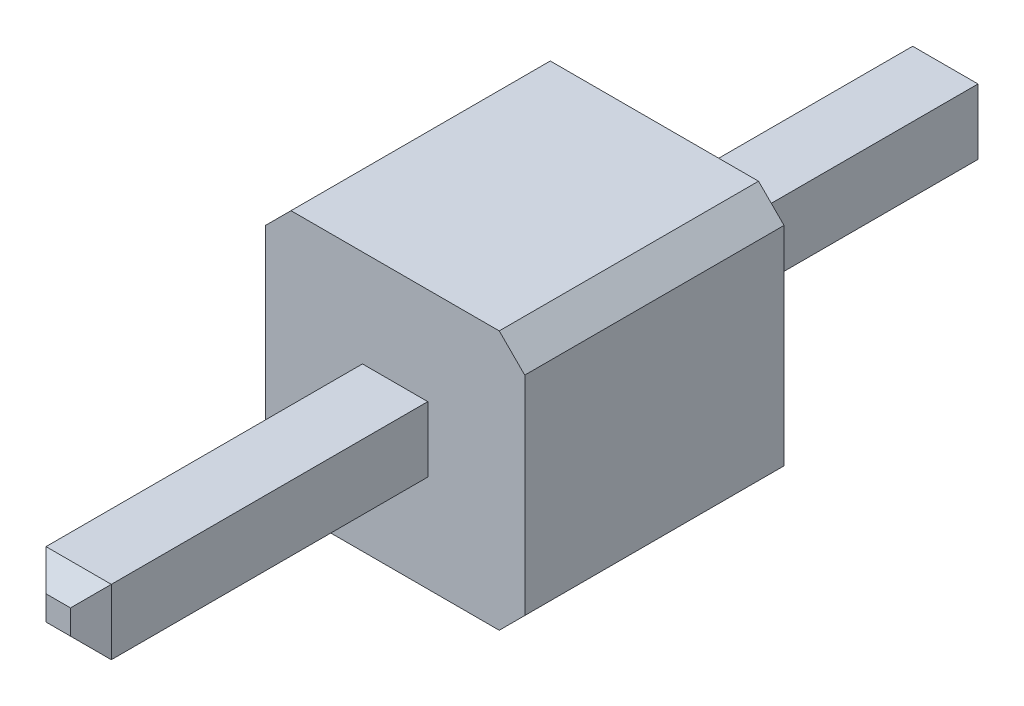
ISO-10303-21;
HEADER;
FILE_DESCRIPTION(('STEP AP214'),'2;1');
FILE_NAME('part.step','',(''),(''),'','','');
FILE_SCHEMA(('AUTOMOTIVE_DESIGN { 1 0 10303 214 1 1 1 1 }'));
ENDSEC;
DATA;
#1=APPLICATION_CONTEXT('core data for automotive mechanical design processes');
#2=APPLICATION_PROTOCOL_DEFINITION('international standard','automotive_design',2000,#1);
#3=PRODUCT_CONTEXT('',#1,'mechanical');
#4=PRODUCT('Part','Part','',(#3));
#5=PRODUCT_RELATED_PRODUCT_CATEGORY('part','',(#4));
#6=PRODUCT_DEFINITION_FORMATION('','',#4);
#7=PRODUCT_DEFINITION_CONTEXT('part definition',#1,'design');
#8=PRODUCT_DEFINITION('design','',#6,#7);
#9=PRODUCT_DEFINITION_SHAPE('','',#8);
#10=(LENGTH_UNIT() NAMED_UNIT(*) SI_UNIT(.MILLI.,.METRE.));
#11=(NAMED_UNIT(*) PLANE_ANGLE_UNIT() SI_UNIT($,.RADIAN.));
#12=(NAMED_UNIT(*) SI_UNIT($,.STERADIAN.) SOLID_ANGLE_UNIT());
#13=UNCERTAINTY_MEASURE_WITH_UNIT(LENGTH_MEASURE(1.E-05),#10,'distance_accuracy_value','');
#14=(GEOMETRIC_REPRESENTATION_CONTEXT(3) GLOBAL_UNCERTAINTY_ASSIGNED_CONTEXT((#13)) GLOBAL_UNIT_ASSIGNED_CONTEXT((#10,
#11,#12)) REPRESENTATION_CONTEXT('',''));
#15=CARTESIAN_POINT('',(0.,0.,0.));
#16=DIRECTION('',(0.,0.,1.));
#17=DIRECTION('',(1.,0.,0.));
#18=AXIS2_PLACEMENT_3D('',#15,#16,#17);
#19=CARTESIAN_POINT('',(0.22,0.,5.74));
#20=DIRECTION('',(0.707106781186548,0.,0.707106781186548));
#21=DIRECTION('',(0.707106781186548,0.,-0.707106781186548));
#22=AXIS2_PLACEMENT_3D('',#19,#20,#21);
#23=PLANE('',#22);
#24=DIRECTION('',(0.,1.,0.));
#25=VECTOR('',#24,1.);
#26=CARTESIAN_POINT('',(0.12,0.,5.84));
#27=LINE('',#26,#25);
#28=CARTESIAN_POINT('',(0.12,-0.12,5.84));
#29=VERTEX_POINT('',#28);
#30=CARTESIAN_POINT('',(0.12,0.12,5.84));
#31=VERTEX_POINT('',#30);
#32=EDGE_CURVE('E20',#29,#31,#27,.T.);
#33=ORIENTED_EDGE('',*,*,#32,.F.);
#34=DIRECTION('',(-0.577350269189626,0.577350269189626,0.577350269189625));
#35=VECTOR('',#34,1.);
#36=CARTESIAN_POINT('',(0.32,-0.32,5.64));
#37=LINE('',#36,#35);
#38=CARTESIAN_POINT('',(0.32,-0.32,5.64));
#39=VERTEX_POINT('',#38);
#40=EDGE_CURVE('E151',#39,#29,#37,.T.);
#41=ORIENTED_EDGE('',*,*,#40,.F.);
#42=DIRECTION('',(0.,1.,0.));
#43=VECTOR('',#42,1.);
#44=CARTESIAN_POINT('',(0.32,0.,5.64));
#45=LINE('',#44,#43);
#46=CARTESIAN_POINT('',(0.32,0.32,5.64));
#47=VERTEX_POINT('',#46);
#48=EDGE_CURVE('E172',#47,#39,#45,.F.);
#49=ORIENTED_EDGE('',*,*,#48,.F.);
#50=DIRECTION('',(0.577350269189626,0.577350269189626,-0.577350269189625));
#51=VECTOR('',#50,1.);
#52=CARTESIAN_POINT('',(0.12,0.12,5.84));
#53=LINE('',#52,#51);
#54=EDGE_CURVE('E168',#31,#47,#53,.T.);
#55=ORIENTED_EDGE('',*,*,#54,.F.);
#56=EDGE_LOOP('',(#33,#41,#49,#55));
#57=FACE_BOUND('',#56,.T.);
#58=ADVANCED_FACE('F17',(#57),#23,.T.);
#59=CARTESIAN_POINT('',(0.,0.,5.84));
#60=DIRECTION('',(0.,0.,1.));
#61=DIRECTION('',(1.,0.,0.));
#62=AXIS2_PLACEMENT_3D('',#59,#60,#61);
#63=PLANE('',#62);
#64=DIRECTION('',(0.,1.,0.));
#65=VECTOR('',#64,1.);
#66=CARTESIAN_POINT('',(-0.12,0.,5.84));
#67=LINE('',#66,#65);
#68=CARTESIAN_POINT('',(-0.12,-0.12,5.84));
#69=VERTEX_POINT('',#68);
#70=CARTESIAN_POINT('',(-0.12,0.12,5.84));
#71=VERTEX_POINT('',#70);
#72=EDGE_CURVE('E184',#69,#71,#67,.T.);
#73=ORIENTED_EDGE('',*,*,#72,.F.);
#74=DIRECTION('',(1.,0.,0.));
#75=VECTOR('',#74,1.);
#76=CARTESIAN_POINT('',(0.,-0.12,5.84));
#77=LINE('',#76,#75);
#78=EDGE_CURVE('E162',#29,#69,#77,.F.);
#79=ORIENTED_EDGE('',*,*,#78,.F.);
#80=ORIENTED_EDGE('',*,*,#32,.T.);
#81=DIRECTION('',(1.,0.,0.));
#82=VECTOR('',#81,1.);
#83=CARTESIAN_POINT('',(0.,0.12,5.84));
#84=LINE('',#83,#82);
#85=EDGE_CURVE('E160',#71,#31,#84,.T.);
#86=ORIENTED_EDGE('',*,*,#85,.F.);
#87=EDGE_LOOP('',(#73,#79,#80,#86));
#88=FACE_BOUND('',#87,.T.);
#89=ADVANCED_FACE('F159',(#88),#63,.T.);
#90=CARTESIAN_POINT('',(0.,0.22,5.74));
#91=DIRECTION('',(0.,0.707106781186548,0.707106781186548));
#92=DIRECTION('',(0.,-0.707106781186548,0.707106781186548));
#93=AXIS2_PLACEMENT_3D('',#90,#91,#92);
#94=PLANE('',#93);
#95=ORIENTED_EDGE('',*,*,#85,.T.);
#96=ORIENTED_EDGE('',*,*,#54,.T.);
#97=DIRECTION('',(1.,0.,0.));
#98=VECTOR('',#97,1.);
#99=CARTESIAN_POINT('',(0.,0.32,5.64));
#100=LINE('',#99,#98);
#101=CARTESIAN_POINT('',(-0.32,0.32,5.64));
#102=VERTEX_POINT('',#101);
#103=EDGE_CURVE('E187',#102,#47,#100,.T.);
#104=ORIENTED_EDGE('',*,*,#103,.F.);
#105=DIRECTION('',(-0.577350269189626,0.577350269189626,-0.577350269189625));
#106=VECTOR('',#105,1.);
#107=CARTESIAN_POINT('',(-0.12,0.12,5.84));
#108=LINE('',#107,#106);
#109=EDGE_CURVE('E170',#71,#102,#108,.T.);
#110=ORIENTED_EDGE('',*,*,#109,.F.);
#111=EDGE_LOOP('',(#95,#96,#104,#110));
#112=FACE_BOUND('',#111,.T.);
#113=ADVANCED_FACE('F166',(#112),#94,.T.);
#114=CARTESIAN_POINT('',(0.,-0.22,5.74));
#115=DIRECTION('',(0.,-0.707106781186548,0.707106781186548));
#116=DIRECTION('',(0.,-0.707106781186548,-0.707106781186548));
#117=AXIS2_PLACEMENT_3D('',#114,#115,#116);
#118=PLANE('',#117);
#119=ORIENTED_EDGE('',*,*,#78,.T.);
#120=DIRECTION('',(0.577350269189626,0.577350269189626,0.577350269189625));
#121=VECTOR('',#120,1.);
#122=CARTESIAN_POINT('',(-0.32,-0.32,5.64));
#123=LINE('',#122,#121);
#124=CARTESIAN_POINT('',(-0.32,-0.32,5.64));
#125=VERTEX_POINT('',#124);
#126=EDGE_CURVE('E181',#125,#69,#123,.T.);
#127=ORIENTED_EDGE('',*,*,#126,.F.);
#128=DIRECTION('',(1.,0.,0.));
#129=VECTOR('',#128,1.);
#130=CARTESIAN_POINT('',(0.,-0.32,5.64));
#131=LINE('',#130,#129);
#132=EDGE_CURVE('E194',#39,#125,#131,.F.);
#133=ORIENTED_EDGE('',*,*,#132,.F.);
#134=ORIENTED_EDGE('',*,*,#40,.T.);
#135=EDGE_LOOP('',(#119,#127,#133,#134));
#136=FACE_BOUND('',#135,.T.);
#137=ADVANCED_FACE('F434',(#136),#118,.T.);
#138=CARTESIAN_POINT('',(0.32,0.,-3.05));
#139=DIRECTION('',(1.,0.,0.));
#140=DIRECTION('',(0.,0.,-1.));
#141=AXIS2_PLACEMENT_3D('',#138,#139,#140);
#142=PLANE('',#141);
#143=DIRECTION('',(0.,1.,0.));
#144=VECTOR('',#143,1.);
#145=CARTESIAN_POINT('',(0.32,0.,2.54));
#146=LINE('',#145,#144);
#147=CARTESIAN_POINT('',(0.32,-0.32,2.54));
#148=VERTEX_POINT('',#147);
#149=CARTESIAN_POINT('',(0.32,0.32,2.54));
#150=VERTEX_POINT('',#149);
#151=EDGE_CURVE('E179',#148,#150,#146,.T.);
#152=ORIENTED_EDGE('',*,*,#151,.T.);
#153=DIRECTION('',(0.,0.,1.));
#154=VECTOR('',#153,1.);
#155=CARTESIAN_POINT('',(0.32,0.32,-3.05));
#156=LINE('',#155,#154);
#157=EDGE_CURVE('E189',#47,#150,#156,.F.);
#158=ORIENTED_EDGE('',*,*,#157,.F.);
#159=ORIENTED_EDGE('',*,*,#48,.T.);
#160=DIRECTION('',(0.,0.,-1.));
#161=VECTOR('',#160,1.);
#162=CARTESIAN_POINT('',(0.32,-0.32,-3.05));
#163=LINE('',#162,#161);
#164=EDGE_CURVE('E198',#148,#39,#163,.F.);
#165=ORIENTED_EDGE('',*,*,#164,.F.);
#166=EDGE_LOOP('',(#152,#158,#159,#165));
#167=FACE_BOUND('',#166,.T.);
#168=ADVANCED_FACE('F430',(#167),#142,.T.);
#169=CARTESIAN_POINT('',(0.,-0.22,-2.95));
#170=DIRECTION('',(0.,-0.707106781186548,-0.707106781186548));
#171=DIRECTION('',(0.,0.707106781186548,-0.707106781186548));
#172=AXIS2_PLACEMENT_3D('',#169,#170,#171);
#173=PLANE('',#172);
#174=DIRECTION('',(1.,0.,0.));
#175=VECTOR('',#174,1.);
#176=CARTESIAN_POINT('',(0.,-0.32,-2.85));
#177=LINE('',#176,#175);
#178=CARTESIAN_POINT('',(-0.32,-0.32,-2.85));
#179=VERTEX_POINT('',#178);
#180=CARTESIAN_POINT('',(0.32,-0.32,-2.85));
#181=VERTEX_POINT('',#180);
#182=EDGE_CURVE('E213',#179,#181,#177,.T.);
#183=ORIENTED_EDGE('',*,*,#182,.F.);
#184=DIRECTION('',(-0.577350269189626,-0.577350269189626,0.577350269189626));
#185=VECTOR('',#184,1.);
#186=CARTESIAN_POINT('',(-0.12,-0.12,-3.05));
#187=LINE('',#186,#185);
#188=CARTESIAN_POINT('',(-0.12,-0.12,-3.05));
#189=VERTEX_POINT('',#188);
#190=EDGE_CURVE('E206',#189,#179,#187,.T.);
#191=ORIENTED_EDGE('',*,*,#190,.F.);
#192=DIRECTION('',(1.,0.,0.));
#193=VECTOR('',#192,1.);
#194=CARTESIAN_POINT('',(0.,-0.12,-3.05));
#195=LINE('',#194,#193);
#196=CARTESIAN_POINT('',(0.12,-0.12,-3.05));
#197=VERTEX_POINT('',#196);
#198=EDGE_CURVE('E201',#189,#197,#195,.T.);
#199=ORIENTED_EDGE('',*,*,#198,.T.);
#200=DIRECTION('',(-0.577350269189626,0.577350269189626,-0.577350269189626));
#201=VECTOR('',#200,1.);
#202=CARTESIAN_POINT('',(0.32,-0.32,-2.85));
#203=LINE('',#202,#201);
#204=EDGE_CURVE('E210',#181,#197,#203,.T.);
#205=ORIENTED_EDGE('',*,*,#204,.F.);
#206=EDGE_LOOP('',(#183,#191,#199,#205));
#207=FACE_BOUND('',#206,.T.);
#208=ADVANCED_FACE('F426',(#207),#173,.T.);
#209=CARTESIAN_POINT('',(-0.22,0.,5.74));
#210=DIRECTION('',(-0.707106781186548,0.,0.707106781186548));
#211=DIRECTION('',(0.707106781186548,0.,0.707106781186548));
#212=AXIS2_PLACEMENT_3D('',#209,#210,#211);
#213=PLANE('',#212);
#214=ORIENTED_EDGE('',*,*,#72,.T.);
#215=ORIENTED_EDGE('',*,*,#109,.T.);
#216=DIRECTION('',(0.,1.,0.));
#217=VECTOR('',#216,1.);
#218=CARTESIAN_POINT('',(-0.32,0.,5.64));
#219=LINE('',#218,#217);
#220=EDGE_CURVE('E217',#125,#102,#219,.T.);
#221=ORIENTED_EDGE('',*,*,#220,.F.);
#222=ORIENTED_EDGE('',*,*,#126,.T.);
#223=EDGE_LOOP('',(#214,#215,#221,#222));
#224=FACE_BOUND('',#223,.T.);
#225=ADVANCED_FACE('F422',(#224),#213,.T.);
#226=CARTESIAN_POINT('',(0.,0.32,-3.05));
#227=DIRECTION('',(0.,1.,0.));
#228=DIRECTION('',(0.,0.,1.));
#229=AXIS2_PLACEMENT_3D('',#226,#227,#228);
#230=PLANE('',#229);
#231=DIRECTION('',(1.,0.,0.));
#232=VECTOR('',#231,1.);
#233=CARTESIAN_POINT('',(0.,0.32,2.54));
#234=LINE('',#233,#232);
#235=CARTESIAN_POINT('',(-0.32,0.32,2.54));
#236=VERTEX_POINT('',#235);
#237=EDGE_CURVE('E192',#150,#236,#234,.F.);
#238=ORIENTED_EDGE('',*,*,#237,.T.);
#239=DIRECTION('',(0.,0.,1.));
#240=VECTOR('',#239,1.);
#241=CARTESIAN_POINT('',(-0.32,0.32,-3.05));
#242=LINE('',#241,#240);
#243=EDGE_CURVE('E220',#102,#236,#242,.F.);
#244=ORIENTED_EDGE('',*,*,#243,.F.);
#245=ORIENTED_EDGE('',*,*,#103,.T.);
#246=ORIENTED_EDGE('',*,*,#157,.T.);
#247=EDGE_LOOP('',(#238,#244,#245,#246));
#248=FACE_BOUND('',#247,.T.);
#249=ADVANCED_FACE('F418',(#248),#230,.T.);
#250=CARTESIAN_POINT('',(0.,-0.32,-3.05));
#251=DIRECTION('',(0.,-1.,0.));
#252=DIRECTION('',(0.,0.,-1.));
#253=AXIS2_PLACEMENT_3D('',#250,#251,#252);
#254=PLANE('',#253);
#255=DIRECTION('',(1.,0.,0.));
#256=VECTOR('',#255,1.);
#257=CARTESIAN_POINT('',(0.,-0.32,2.54));
#258=LINE('',#257,#256);
#259=CARTESIAN_POINT('',(-0.32,-0.32,2.54));
#260=VERTEX_POINT('',#259);
#261=EDGE_CURVE('E196',#260,#148,#258,.T.);
#262=ORIENTED_EDGE('',*,*,#261,.T.);
#263=ORIENTED_EDGE('',*,*,#164,.T.);
#264=ORIENTED_EDGE('',*,*,#132,.T.);
#265=DIRECTION('',(0.,0.,1.));
#266=VECTOR('',#265,1.);
#267=CARTESIAN_POINT('',(-0.32,-0.32,-3.05));
#268=LINE('',#267,#266);
#269=EDGE_CURVE('E223',#260,#125,#268,.T.);
#270=ORIENTED_EDGE('',*,*,#269,.F.);
#271=EDGE_LOOP('',(#262,#263,#264,#270));
#272=FACE_BOUND('',#271,.T.);
#273=ADVANCED_FACE('F414',(#272),#254,.T.);
#274=CARTESIAN_POINT('',(0.,0.,-3.05));
#275=DIRECTION('',(0.,0.,1.));
#276=DIRECTION('',(1.,0.,0.));
#277=AXIS2_PLACEMENT_3D('',#274,#275,#276);
#278=PLANE('',#277);
#279=DIRECTION('',(0.,1.,0.));
#280=VECTOR('',#279,1.);
#281=CARTESIAN_POINT('',(0.12,0.,-3.05));
#282=LINE('',#281,#280);
#283=CARTESIAN_POINT('',(0.12,0.12,-3.05));
#284=VERTEX_POINT('',#283);
#285=EDGE_CURVE('E208',#197,#284,#282,.T.);
#286=ORIENTED_EDGE('',*,*,#285,.F.);
#287=ORIENTED_EDGE('',*,*,#198,.F.);
#288=DIRECTION('',(0.,1.,0.));
#289=VECTOR('',#288,1.);
#290=CARTESIAN_POINT('',(-0.12,0.,-3.05));
#291=LINE('',#290,#289);
#292=CARTESIAN_POINT('',(-0.12,0.12,-3.05));
#293=VERTEX_POINT('',#292);
#294=EDGE_CURVE('E203',#293,#189,#291,.F.);
#295=ORIENTED_EDGE('',*,*,#294,.F.);
#296=DIRECTION('',(1.,0.,0.));
#297=VECTOR('',#296,1.);
#298=CARTESIAN_POINT('',(0.,0.12,-3.05));
#299=LINE('',#298,#297);
#300=EDGE_CURVE('E226',#284,#293,#299,.F.);
#301=ORIENTED_EDGE('',*,*,#300,.F.);
#302=EDGE_LOOP('',(#286,#287,#295,#301));
#303=FACE_BOUND('',#302,.T.);
#304=ADVANCED_FACE('F410',(#303),#278,.F.);
#305=CARTESIAN_POINT('',(-0.22,0.,-2.95));
#306=DIRECTION('',(-0.707106781186548,0.,-0.707106781186548));
#307=DIRECTION('',(-0.707106781186548,0.,0.707106781186548));
#308=AXIS2_PLACEMENT_3D('',#305,#306,#307);
#309=PLANE('',#308);
#310=DIRECTION('',(0.,1.,0.));
#311=VECTOR('',#310,1.);
#312=CARTESIAN_POINT('',(-0.32,0.,-2.85));
#313=LINE('',#312,#311);
#314=CARTESIAN_POINT('',(-0.32,0.32,-2.85));
#315=VERTEX_POINT('',#314);
#316=EDGE_CURVE('E233',#315,#179,#313,.F.);
#317=ORIENTED_EDGE('',*,*,#316,.F.);
#318=DIRECTION('',(-0.577350269189626,0.577350269189626,0.577350269189626));
#319=VECTOR('',#318,1.);
#320=CARTESIAN_POINT('',(-0.12,0.12,-3.05));
#321=LINE('',#320,#319);
#322=EDGE_CURVE('E228',#293,#315,#321,.T.);
#323=ORIENTED_EDGE('',*,*,#322,.F.);
#324=ORIENTED_EDGE('',*,*,#294,.T.);
#325=ORIENTED_EDGE('',*,*,#190,.T.);
#326=EDGE_LOOP('',(#317,#323,#324,#325));
#327=FACE_BOUND('',#326,.T.);
#328=ADVANCED_FACE('F406',(#327),#309,.T.);
#329=CARTESIAN_POINT('',(0.22,0.,-2.95));
#330=DIRECTION('',(0.707106781186548,0.,-0.707106781186548));
#331=DIRECTION('',(-0.707106781186548,0.,-0.707106781186548));
#332=AXIS2_PLACEMENT_3D('',#329,#330,#331);
#333=PLANE('',#332);
#334=DIRECTION('',(0.,1.,0.));
#335=VECTOR('',#334,1.);
#336=CARTESIAN_POINT('',(0.32,0.,-2.85));
#337=LINE('',#336,#335);
#338=CARTESIAN_POINT('',(0.32,0.32,-2.85));
#339=VERTEX_POINT('',#338);
#340=EDGE_CURVE('E241',#181,#339,#337,.T.);
#341=ORIENTED_EDGE('',*,*,#340,.F.);
#342=ORIENTED_EDGE('',*,*,#204,.T.);
#343=ORIENTED_EDGE('',*,*,#285,.T.);
#344=DIRECTION('',(-0.577350269189626,-0.577350269189626,-0.577350269189626));
#345=VECTOR('',#344,1.);
#346=CARTESIAN_POINT('',(0.32,0.32,-2.85));
#347=LINE('',#346,#345);
#348=EDGE_CURVE('E230',#339,#284,#347,.T.);
#349=ORIENTED_EDGE('',*,*,#348,.F.);
#350=EDGE_LOOP('',(#341,#342,#343,#349));
#351=FACE_BOUND('',#350,.T.);
#352=ADVANCED_FACE('F402',(#351),#333,.T.);
#353=CARTESIAN_POINT('',(0.,-0.32,-3.05));
#354=DIRECTION('',(0.,-1.,0.));
#355=DIRECTION('',(0.,0.,-1.));
#356=AXIS2_PLACEMENT_3D('',#353,#354,#355);
#357=PLANE('',#356);
#358=DIRECTION('',(1.,0.,0.));
#359=VECTOR('',#358,1.);
#360=CARTESIAN_POINT('',(0.,-0.32,0.));
#361=LINE('',#360,#359);
#362=CARTESIAN_POINT('',(0.32,-0.32,0.));
#363=VERTEX_POINT('',#362);
#364=CARTESIAN_POINT('',(-0.32,-0.32,0.));
#365=VERTEX_POINT('',#364);
#366=EDGE_CURVE('E215',#363,#365,#361,.F.);
#367=ORIENTED_EDGE('',*,*,#366,.T.);
#368=DIRECTION('',(0.,0.,1.));
#369=VECTOR('',#368,1.);
#370=CARTESIAN_POINT('',(-0.32,-0.32,-3.05));
#371=LINE('',#370,#369);
#372=EDGE_CURVE('E236',#179,#365,#371,.T.);
#373=ORIENTED_EDGE('',*,*,#372,.F.);
#374=ORIENTED_EDGE('',*,*,#182,.T.);
#375=DIRECTION('',(0.,0.,-1.));
#376=VECTOR('',#375,1.);
#377=CARTESIAN_POINT('',(0.32,-0.32,-3.05));
#378=LINE('',#377,#376);
#379=EDGE_CURVE('E245',#363,#181,#378,.T.);
#380=ORIENTED_EDGE('',*,*,#379,.F.);
#381=EDGE_LOOP('',(#367,#373,#374,#380));
#382=FACE_BOUND('',#381,.T.);
#383=ADVANCED_FACE('F398',(#382),#357,.T.);
#384=CARTESIAN_POINT('',(-0.32,0.,-3.05));
#385=DIRECTION('',(-1.,0.,0.));
#386=DIRECTION('',(0.,0.,1.));
#387=AXIS2_PLACEMENT_3D('',#384,#385,#386);
#388=PLANE('',#387);
#389=DIRECTION('',(0.,1.,0.));
#390=VECTOR('',#389,1.);
#391=CARTESIAN_POINT('',(-0.32,0.,2.54));
#392=LINE('',#391,#390);
#393=EDGE_CURVE('E253',#260,#236,#392,.T.);
#394=ORIENTED_EDGE('',*,*,#393,.F.);
#395=ORIENTED_EDGE('',*,*,#269,.T.);
#396=ORIENTED_EDGE('',*,*,#220,.T.);
#397=ORIENTED_EDGE('',*,*,#243,.T.);
#398=EDGE_LOOP('',(#394,#395,#396,#397));
#399=FACE_BOUND('',#398,.T.);
#400=ADVANCED_FACE('F394',(#399),#388,.T.);
#401=CARTESIAN_POINT('',(0.,0.22,-2.95));
#402=DIRECTION('',(0.,0.707106781186548,-0.707106781186548));
#403=DIRECTION('',(0.,0.707106781186548,0.707106781186548));
#404=AXIS2_PLACEMENT_3D('',#401,#402,#403);
#405=PLANE('',#404);
#406=DIRECTION('',(1.,0.,0.));
#407=VECTOR('',#406,1.);
#408=CARTESIAN_POINT('',(0.,0.32,-2.85));
#409=LINE('',#408,#407);
#410=EDGE_CURVE('E266',#339,#315,#409,.F.);
#411=ORIENTED_EDGE('',*,*,#410,.F.);
#412=ORIENTED_EDGE('',*,*,#348,.T.);
#413=ORIENTED_EDGE('',*,*,#300,.T.);
#414=ORIENTED_EDGE('',*,*,#322,.T.);
#415=EDGE_LOOP('',(#411,#412,#413,#414));
#416=FACE_BOUND('',#415,.T.);
#417=ADVANCED_FACE('F390',(#416),#405,.T.);
#418=CARTESIAN_POINT('',(-0.32,0.,-3.05));
#419=DIRECTION('',(-1.,0.,0.));
#420=DIRECTION('',(0.,0.,1.));
#421=AXIS2_PLACEMENT_3D('',#418,#419,#420);
#422=PLANE('',#421);
#423=DIRECTION('',(0.,1.,0.));
#424=VECTOR('',#423,1.);
#425=CARTESIAN_POINT('',(-0.32,0.,0.));
#426=LINE('',#425,#424);
#427=CARTESIAN_POINT('',(-0.32,0.32,0.));
#428=VERTEX_POINT('',#427);
#429=EDGE_CURVE('E239',#365,#428,#426,.T.);
#430=ORIENTED_EDGE('',*,*,#429,.T.);
#431=DIRECTION('',(0.,0.,1.));
#432=VECTOR('',#431,1.);
#433=CARTESIAN_POINT('',(-0.32,0.32,-3.05));
#434=LINE('',#433,#432);
#435=EDGE_CURVE('E269',#315,#428,#434,.T.);
#436=ORIENTED_EDGE('',*,*,#435,.F.);
#437=ORIENTED_EDGE('',*,*,#316,.T.);
#438=ORIENTED_EDGE('',*,*,#372,.T.);
#439=EDGE_LOOP('',(#430,#436,#437,#438));
#440=FACE_BOUND('',#439,.T.);
#441=ADVANCED_FACE('F386',(#440),#422,.T.);
#442=CARTESIAN_POINT('',(0.32,0.,-3.05));
#443=DIRECTION('',(1.,0.,0.));
#444=DIRECTION('',(0.,0.,-1.));
#445=AXIS2_PLACEMENT_3D('',#442,#443,#444);
#446=PLANE('',#445);
#447=DIRECTION('',(0.,1.,0.));
#448=VECTOR('',#447,1.);
#449=CARTESIAN_POINT('',(0.32,0.,0.));
#450=LINE('',#449,#448);
#451=CARTESIAN_POINT('',(0.32,0.32,0.));
#452=VERTEX_POINT('',#451);
#453=EDGE_CURVE('E243',#452,#363,#450,.F.);
#454=ORIENTED_EDGE('',*,*,#453,.T.);
#455=ORIENTED_EDGE('',*,*,#379,.T.);
#456=ORIENTED_EDGE('',*,*,#340,.T.);
#457=DIRECTION('',(0.,0.,1.));
#458=VECTOR('',#457,1.);
#459=CARTESIAN_POINT('',(0.32,0.32,-3.05));
#460=LINE('',#459,#458);
#461=EDGE_CURVE('E272',#452,#339,#460,.F.);
#462=ORIENTED_EDGE('',*,*,#461,.F.);
#463=EDGE_LOOP('',(#454,#455,#456,#462));
#464=FACE_BOUND('',#463,.T.);
#465=ADVANCED_FACE('F383',(#464),#446,.T.);
#466=CARTESIAN_POINT('',(1.145,-1.145,0.));
#467=DIRECTION('',(0.707106781186548,-0.707106781186548,0.));
#468=DIRECTION('',(0.707106781186548,0.707106781186548,0.));
#469=AXIS2_PLACEMENT_3D('',#466,#467,#468);
#470=PLANE('',#469);
#471=DIRECTION('',(0.707106781186548,0.707106781186548,0.));
#472=VECTOR('',#471,1.);
#473=CARTESIAN_POINT('',(1.145,-1.145,0.));
#474=LINE('',#473,#472);
#475=CARTESIAN_POINT('',(1.02,-1.27,0.));
#476=VERTEX_POINT('',#475);
#477=CARTESIAN_POINT('',(1.27,-1.02,0.));
#478=VERTEX_POINT('',#477);
#479=EDGE_CURVE('E248',#476,#478,#474,.T.);
#480=ORIENTED_EDGE('',*,*,#479,.T.);
#481=DIRECTION('',(0.,0.,-1.));
#482=VECTOR('',#481,1.);
#483=CARTESIAN_POINT('',(1.27,-1.02,0.));
#484=LINE('',#483,#482);
#485=CARTESIAN_POINT('',(1.27,-1.02,2.54));
#486=VERTEX_POINT('',#485);
#487=EDGE_CURVE('E283',#486,#478,#484,.T.);
#488=ORIENTED_EDGE('',*,*,#487,.F.);
#489=DIRECTION('',(0.707106781186548,0.707106781186548,0.));
#490=VECTOR('',#489,1.);
#491=CARTESIAN_POINT('',(1.02,-1.27,2.54));
#492=LINE('',#491,#490);
#493=CARTESIAN_POINT('',(1.02,-1.27,2.54));
#494=VERTEX_POINT('',#493);
#495=EDGE_CURVE('E258',#494,#486,#492,.T.);
#496=ORIENTED_EDGE('',*,*,#495,.F.);
#497=DIRECTION('',(0.,0.,-1.));
#498=VECTOR('',#497,1.);
#499=CARTESIAN_POINT('',(1.02,-1.27,0.));
#500=LINE('',#499,#498);
#501=EDGE_CURVE('E278',#476,#494,#500,.F.);
#502=ORIENTED_EDGE('',*,*,#501,.F.);
#503=EDGE_LOOP('',(#480,#488,#496,#502));
#504=FACE_BOUND('',#503,.T.);
#505=ADVANCED_FACE('F345',(#504),#470,.T.);
#506=CARTESIAN_POINT('',(1.145,1.145,0.));
#507=DIRECTION('',(0.707106781186548,0.707106781186548,0.));
#508=DIRECTION('',(-0.707106781186548,0.707106781186548,0.));
#509=AXIS2_PLACEMENT_3D('',#506,#507,#508);
#510=PLANE('',#509);
#511=DIRECTION('',(-0.707106781186548,0.707106781186548,0.));
#512=VECTOR('',#511,1.);
#513=CARTESIAN_POINT('',(1.145,1.145,0.));
#514=LINE('',#513,#512);
#515=CARTESIAN_POINT('',(1.27,1.02,0.));
#516=VERTEX_POINT('',#515);
#517=CARTESIAN_POINT('',(1.02,1.27,0.));
#518=VERTEX_POINT('',#517);
#519=EDGE_CURVE('E250',#516,#518,#514,.T.);
#520=ORIENTED_EDGE('',*,*,#519,.T.);
#521=DIRECTION('',(0.,0.,1.));
#522=VECTOR('',#521,1.);
#523=CARTESIAN_POINT('',(1.02,1.27,0.));
#524=LINE('',#523,#522);
#525=CARTESIAN_POINT('',(1.02,1.27,2.54));
#526=VERTEX_POINT('',#525);
#527=EDGE_CURVE('E297',#526,#518,#524,.F.);
#528=ORIENTED_EDGE('',*,*,#527,.F.);
#529=DIRECTION('',(-0.707106781186548,0.707106781186548,0.));
#530=VECTOR('',#529,1.);
#531=CARTESIAN_POINT('',(1.27,1.02,2.54));
#532=LINE('',#531,#530);
#533=CARTESIAN_POINT('',(1.27,1.02,2.54));
#534=VERTEX_POINT('',#533);
#535=EDGE_CURVE('E260',#534,#526,#532,.T.);
#536=ORIENTED_EDGE('',*,*,#535,.F.);
#537=DIRECTION('',(0.,0.,-1.));
#538=VECTOR('',#537,1.);
#539=CARTESIAN_POINT('',(1.27,1.02,0.));
#540=LINE('',#539,#538);
#541=EDGE_CURVE('E286',#516,#534,#540,.F.);
#542=ORIENTED_EDGE('',*,*,#541,.F.);
#543=EDGE_LOOP('',(#520,#528,#536,#542));
#544=FACE_BOUND('',#543,.T.);
#545=ADVANCED_FACE('F338',(#544),#510,.T.);
#546=CARTESIAN_POINT('',(-1.145,-1.145,0.));
#547=DIRECTION('',(-0.707106781186548,-0.707106781186548,0.));
#548=DIRECTION('',(0.707106781186548,-0.707106781186548,0.));
#549=AXIS2_PLACEMENT_3D('',#546,#547,#548);
#550=PLANE('',#549);
#551=DIRECTION('',(0.707106781186548,-0.707106781186548,0.));
#552=VECTOR('',#551,1.);
#553=CARTESIAN_POINT('',(-1.145,-1.145,0.));
#554=LINE('',#553,#552);
#555=CARTESIAN_POINT('',(-1.27,-1.02,0.));
#556=VERTEX_POINT('',#555);
#557=CARTESIAN_POINT('',(-1.02,-1.27,0.));
#558=VERTEX_POINT('',#557);
#559=EDGE_CURVE('E35',#556,#558,#554,.T.);
#560=ORIENTED_EDGE('',*,*,#559,.T.);
#561=DIRECTION('',(0.,0.,-1.));
#562=VECTOR('',#561,1.);
#563=CARTESIAN_POINT('',(-1.02,-1.27,0.));
#564=LINE('',#563,#562);
#565=CARTESIAN_POINT('',(-1.02,-1.27,2.54));
#566=VERTEX_POINT('',#565);
#567=EDGE_CURVE('E275',#566,#558,#564,.T.);
#568=ORIENTED_EDGE('',*,*,#567,.F.);
#569=DIRECTION('',(0.707106781186548,-0.707106781186548,0.));
#570=VECTOR('',#569,1.);
#571=CARTESIAN_POINT('',(-1.27,-1.02,2.54));
#572=LINE('',#571,#570);
#573=CARTESIAN_POINT('',(-1.27,-1.02,2.54));
#574=VERTEX_POINT('',#573);
#575=EDGE_CURVE('E256',#574,#566,#572,.T.);
#576=ORIENTED_EDGE('',*,*,#575,.F.);
#577=DIRECTION('',(0.,0.,1.));
#578=VECTOR('',#577,1.);
#579=CARTESIAN_POINT('',(-1.27,-1.02,0.));
#580=LINE('',#579,#578);
#581=EDGE_CURVE('E300',#556,#574,#580,.T.);
#582=ORIENTED_EDGE('',*,*,#581,.F.);
#583=EDGE_LOOP('',(#560,#568,#576,#582));
#584=FACE_BOUND('',#583,.T.);
#585=ADVANCED_FACE('F352',(#584),#550,.T.);
#586=CARTESIAN_POINT('',(0.,0.,2.54));
#587=DIRECTION('',(0.,0.,1.));
#588=DIRECTION('',(1.,0.,0.));
#589=AXIS2_PLACEMENT_3D('',#586,#587,#588);
#590=PLANE('',#589);
#591=DIRECTION('',(-0.707106781186548,-0.707106781186548,0.));
#592=VECTOR('',#591,1.);
#593=CARTESIAN_POINT('',(-1.145,1.145,2.54));
#594=LINE('',#593,#592);
#595=CARTESIAN_POINT('',(-1.27,1.02,2.54));
#596=VERTEX_POINT('',#595);
#597=CARTESIAN_POINT('',(-1.02,1.27,2.54));
#598=VERTEX_POINT('',#597);
#599=EDGE_CURVE('E262',#596,#598,#594,.F.);
#600=ORIENTED_EDGE('',*,*,#599,.F.);
#601=DIRECTION('',(0.,1.,0.));
#602=VECTOR('',#601,1.);
#603=CARTESIAN_POINT('',(-1.27,0.,2.54));
#604=LINE('',#603,#602);
#605=EDGE_CURVE('E302',#574,#596,#604,.T.);
#606=ORIENTED_EDGE('',*,*,#605,.F.);
#607=ORIENTED_EDGE('',*,*,#575,.T.);
#608=DIRECTION('',(1.,0.,0.));
#609=VECTOR('',#608,1.);
#610=CARTESIAN_POINT('',(0.,-1.27,2.54));
#611=LINE('',#610,#609);
#612=EDGE_CURVE('E280',#494,#566,#611,.F.);
#613=ORIENTED_EDGE('',*,*,#612,.F.);
#614=ORIENTED_EDGE('',*,*,#495,.T.);
#615=DIRECTION('',(0.,1.,0.));
#616=VECTOR('',#615,1.);
#617=CARTESIAN_POINT('',(1.27,0.,2.54));
#618=LINE('',#617,#616);
#619=EDGE_CURVE('E288',#534,#486,#618,.F.);
#620=ORIENTED_EDGE('',*,*,#619,.F.);
#621=ORIENTED_EDGE('',*,*,#535,.T.);
#622=DIRECTION('',(1.,0.,0.));
#623=VECTOR('',#622,1.);
#624=CARTESIAN_POINT('',(0.,1.27,2.54));
#625=LINE('',#624,#623);
#626=EDGE_CURVE('E294',#598,#526,#625,.T.);
#627=ORIENTED_EDGE('',*,*,#626,.F.);
#628=EDGE_LOOP('',(#600,#606,#607,#613,#614,#620,#621,#627));
#629=FACE_BOUND('',#628,.T.);
#630=ORIENTED_EDGE('',*,*,#261,.F.);
#631=ORIENTED_EDGE('',*,*,#393,.T.);
#632=ORIENTED_EDGE('',*,*,#237,.F.);
#633=ORIENTED_EDGE('',*,*,#151,.F.);
#634=EDGE_LOOP('',(#630,#631,#632,#633));
#635=FACE_BOUND('',#634,.T.);
#636=ADVANCED_FACE('F333',(#629,#635),#590,.T.);
#637=CARTESIAN_POINT('',(-1.145,1.145,0.));
#638=DIRECTION('',(-0.707106781186548,0.707106781186548,0.));
#639=DIRECTION('',(-0.707106781186548,-0.707106781186548,0.));
#640=AXIS2_PLACEMENT_3D('',#637,#638,#639);
#641=PLANE('',#640);
#642=DIRECTION('',(-0.707106781186548,-0.707106781186548,0.));
#643=VECTOR('',#642,1.);
#644=CARTESIAN_POINT('',(-1.145,1.145,0.));
#645=LINE('',#644,#643);
#646=CARTESIAN_POINT('',(-1.02,1.27,0.));
#647=VERTEX_POINT('',#646);
#648=CARTESIAN_POINT('',(-1.27,1.02,0.));
#649=VERTEX_POINT('',#648);
#650=EDGE_CURVE('E264',#647,#649,#645,.T.);
#651=ORIENTED_EDGE('',*,*,#650,.T.);
#652=DIRECTION('',(0.,0.,1.));
#653=VECTOR('',#652,1.);
#654=CARTESIAN_POINT('',(-1.27,1.02,0.));
#655=LINE('',#654,#653);
#656=EDGE_CURVE('E304',#596,#649,#655,.F.);
#657=ORIENTED_EDGE('',*,*,#656,.F.);
#658=ORIENTED_EDGE('',*,*,#599,.T.);
#659=DIRECTION('',(0.,0.,1.));
#660=VECTOR('',#659,1.);
#661=CARTESIAN_POINT('',(-1.02,1.27,0.));
#662=LINE('',#661,#660);
#663=EDGE_CURVE('E291',#647,#598,#662,.T.);
#664=ORIENTED_EDGE('',*,*,#663,.F.);
#665=EDGE_LOOP('',(#651,#657,#658,#664));
#666=FACE_BOUND('',#665,.T.);
#667=ADVANCED_FACE('F329',(#666),#641,.T.);
#668=CARTESIAN_POINT('',(0.,0.32,-3.05));
#669=DIRECTION('',(0.,1.,0.));
#670=DIRECTION('',(0.,0.,1.));
#671=AXIS2_PLACEMENT_3D('',#668,#669,#670);
#672=PLANE('',#671);
#673=DIRECTION('',(1.,0.,0.));
#674=VECTOR('',#673,1.);
#675=CARTESIAN_POINT('',(0.,0.32,0.));
#676=LINE('',#675,#674);
#677=EDGE_CURVE('E307',#428,#452,#676,.T.);
#678=ORIENTED_EDGE('',*,*,#677,.T.);
#679=ORIENTED_EDGE('',*,*,#461,.T.);
#680=ORIENTED_EDGE('',*,*,#410,.T.);
#681=ORIENTED_EDGE('',*,*,#435,.T.);
#682=EDGE_LOOP('',(#678,#679,#680,#681));
#683=FACE_BOUND('',#682,.T.);
#684=ADVANCED_FACE('F369',(#683),#672,.T.);
#685=CARTESIAN_POINT('',(0.,-1.27,0.));
#686=DIRECTION('',(0.,-1.,0.));
#687=DIRECTION('',(0.,0.,-1.));
#688=AXIS2_PLACEMENT_3D('',#685,#686,#687);
#689=PLANE('',#688);
#690=ORIENTED_EDGE('',*,*,#501,.T.);
#691=ORIENTED_EDGE('',*,*,#612,.T.);
#692=ORIENTED_EDGE('',*,*,#567,.T.);
#693=DIRECTION('',(1.,0.,0.));
#694=VECTOR('',#693,1.);
#695=CARTESIAN_POINT('',(0.,-1.27,0.));
#696=LINE('',#695,#694);
#697=EDGE_CURVE('E310',#558,#476,#696,.T.);
#698=ORIENTED_EDGE('',*,*,#697,.T.);
#699=EDGE_LOOP('',(#690,#691,#692,#698));
#700=FACE_BOUND('',#699,.T.);
#701=ADVANCED_FACE('F348',(#700),#689,.T.);
#702=CARTESIAN_POINT('',(1.27,0.,0.));
#703=DIRECTION('',(1.,0.,0.));
#704=DIRECTION('',(0.,0.,-1.));
#705=AXIS2_PLACEMENT_3D('',#702,#703,#704);
#706=PLANE('',#705);
#707=ORIENTED_EDGE('',*,*,#541,.T.);
#708=ORIENTED_EDGE('',*,*,#619,.T.);
#709=ORIENTED_EDGE('',*,*,#487,.T.);
#710=DIRECTION('',(0.,1.,0.));
#711=VECTOR('',#710,1.);
#712=CARTESIAN_POINT('',(1.27,0.,0.));
#713=LINE('',#712,#711);
#714=EDGE_CURVE('E313',#478,#516,#713,.T.);
#715=ORIENTED_EDGE('',*,*,#714,.T.);
#716=EDGE_LOOP('',(#707,#708,#709,#715));
#717=FACE_BOUND('',#716,.T.);
#718=ADVANCED_FACE('F340',(#717),#706,.T.);
#719=CARTESIAN_POINT('',(0.,1.27,0.));
#720=DIRECTION('',(0.,1.,0.));
#721=DIRECTION('',(0.,0.,1.));
#722=AXIS2_PLACEMENT_3D('',#719,#720,#721);
#723=PLANE('',#722);
#724=ORIENTED_EDGE('',*,*,#527,.T.);
#725=DIRECTION('',(1.,0.,0.));
#726=VECTOR('',#725,1.);
#727=CARTESIAN_POINT('',(0.,1.27,0.));
#728=LINE('',#727,#726);
#729=EDGE_CURVE('E26',#518,#647,#728,.F.);
#730=ORIENTED_EDGE('',*,*,#729,.T.);
#731=ORIENTED_EDGE('',*,*,#663,.T.);
#732=ORIENTED_EDGE('',*,*,#626,.T.);
#733=EDGE_LOOP('',(#724,#730,#731,#732));
#734=FACE_BOUND('',#733,.T.);
#735=ADVANCED_FACE('F319',(#734),#723,.T.);
#736=CARTESIAN_POINT('',(-1.27,0.,0.));
#737=DIRECTION('',(-1.,0.,0.));
#738=DIRECTION('',(0.,0.,1.));
#739=AXIS2_PLACEMENT_3D('',#736,#737,#738);
#740=PLANE('',#739);
#741=ORIENTED_EDGE('',*,*,#656,.T.);
#742=DIRECTION('',(0.,1.,0.));
#743=VECTOR('',#742,1.);
#744=CARTESIAN_POINT('',(-1.27,0.,0.));
#745=LINE('',#744,#743);
#746=EDGE_CURVE('E11',#649,#556,#745,.F.);
#747=ORIENTED_EDGE('',*,*,#746,.T.);
#748=ORIENTED_EDGE('',*,*,#581,.T.);
#749=ORIENTED_EDGE('',*,*,#605,.T.);
#750=EDGE_LOOP('',(#741,#747,#748,#749));
#751=FACE_BOUND('',#750,.T.);
#752=ADVANCED_FACE('F354',(#751),#740,.T.);
#753=CARTESIAN_POINT('',(0.,0.,0.));
#754=DIRECTION('',(0.,0.,1.));
#755=DIRECTION('',(1.,0.,0.));
#756=AXIS2_PLACEMENT_3D('',#753,#754,#755);
#757=PLANE('',#756);
#758=ORIENTED_EDGE('',*,*,#746,.F.);
#759=ORIENTED_EDGE('',*,*,#650,.F.);
#760=ORIENTED_EDGE('',*,*,#729,.F.);
#761=ORIENTED_EDGE('',*,*,#519,.F.);
#762=ORIENTED_EDGE('',*,*,#714,.F.);
#763=ORIENTED_EDGE('',*,*,#479,.F.);
#764=ORIENTED_EDGE('',*,*,#697,.F.);
#765=ORIENTED_EDGE('',*,*,#559,.F.);
#766=EDGE_LOOP('',(#758,#759,#760,#761,#762,#763,#764,#765));
#767=FACE_BOUND('',#766,.T.);
#768=ORIENTED_EDGE('',*,*,#429,.F.);
#769=ORIENTED_EDGE('',*,*,#366,.F.);
#770=ORIENTED_EDGE('',*,*,#453,.F.);
#771=ORIENTED_EDGE('',*,*,#677,.F.);
#772=EDGE_LOOP('',(#768,#769,#770,#771));
#773=FACE_BOUND('',#772,.T.);
#774=ADVANCED_FACE('F323',(#767,#773),#757,.F.);
#775=CLOSED_SHELL('',(#58,#89,#113,#137,#168,#208,#225,#249,#273,#304,#328,#352,#383,#400,#417,
#441,#465,#505,#545,#585,#636,#667,#684,#701,#718,#735,#752,#774));
#776=MANIFOLD_SOLID_BREP('B1',#775);
#777=ADVANCED_BREP_SHAPE_REPRESENTATION('',(#18,#776),#14);
#778=SHAPE_DEFINITION_REPRESENTATION(#9,#777);
ENDSEC;
END-ISO-10303-21;
